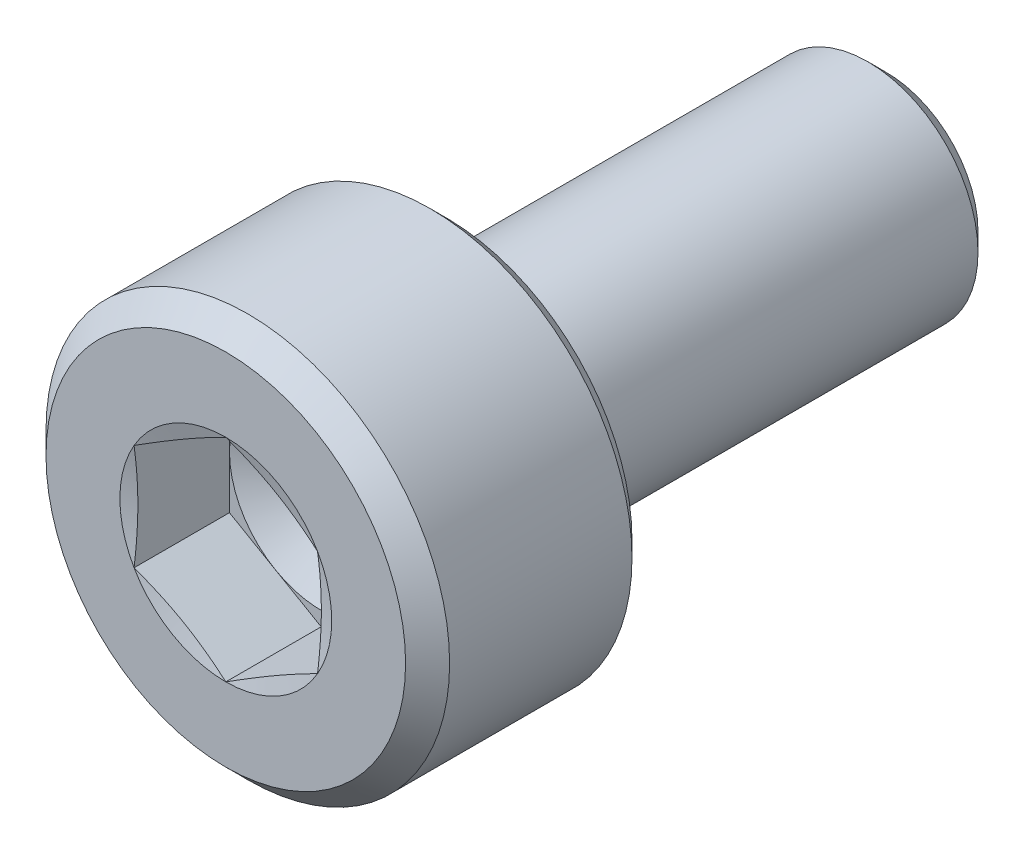
ISO-10303-21;
HEADER;
FILE_DESCRIPTION(('STEP AP214'),'2;1');
FILE_NAME('part.step','',(''),(''),'','','');
FILE_SCHEMA(('AUTOMOTIVE_DESIGN { 1 0 10303 214 1 1 1 1 }'));
ENDSEC;
DATA;
#1=APPLICATION_CONTEXT('core data for automotive mechanical design processes');
#2=APPLICATION_PROTOCOL_DEFINITION('international standard','automotive_design',2000,#1);
#3=PRODUCT_CONTEXT('',#1,'mechanical');
#4=PRODUCT('Part','Part','',(#3));
#5=PRODUCT_RELATED_PRODUCT_CATEGORY('part','',(#4));
#6=PRODUCT_DEFINITION_FORMATION('','',#4);
#7=PRODUCT_DEFINITION_CONTEXT('part definition',#1,'design');
#8=PRODUCT_DEFINITION('design','',#6,#7);
#9=PRODUCT_DEFINITION_SHAPE('','',#8);
#10=(LENGTH_UNIT() NAMED_UNIT(*) SI_UNIT(.MILLI.,.METRE.));
#11=(NAMED_UNIT(*) PLANE_ANGLE_UNIT() SI_UNIT($,.RADIAN.));
#12=(NAMED_UNIT(*) SI_UNIT($,.STERADIAN.) SOLID_ANGLE_UNIT());
#13=UNCERTAINTY_MEASURE_WITH_UNIT(LENGTH_MEASURE(1.E-05),#10,'distance_accuracy_value','');
#14=(GEOMETRIC_REPRESENTATION_CONTEXT(3) GLOBAL_UNCERTAINTY_ASSIGNED_CONTEXT((#13)) GLOBAL_UNIT_ASSIGNED_CONTEXT((#10,
#11,#12)) REPRESENTATION_CONTEXT('',''));
#15=CARTESIAN_POINT('',(0.,0.,0.));
#16=DIRECTION('',(0.,0.,1.));
#17=DIRECTION('',(1.,0.,0.));
#18=AXIS2_PLACEMENT_3D('',#15,#16,#17);
#19=CARTESIAN_POINT('',(0.,0.,0.));
#20=DIRECTION('',(0.,0.,-1.));
#21=DIRECTION('',(-1.,0.,0.));
#22=AXIS2_PLACEMENT_3D('',#19,#20,#21);
#23=PLANE('',#22);
#24=CARTESIAN_POINT('',(0.,0.,0.));
#25=DIRECTION('',(0.,0.,1.));
#26=DIRECTION('',(1.,0.,0.));
#27=AXIS2_PLACEMENT_3D('',#24,#25,#26);
#28=CIRCLE('',#27,2.44999999999999);
#29=CARTESIAN_POINT('',(2.44999999999999,0.,0.));
#30=VERTEX_POINT('',#29);
#31=EDGE_CURVE('E230',#30,#30,#28,.T.);
#32=ORIENTED_EDGE('',*,*,#31,.T.);
#33=EDGE_LOOP('',(#32));
#34=FACE_BOUND('',#33,.T.);
#35=CARTESIAN_POINT('',(0.,0.,0.));
#36=DIRECTION('',(0.,0.,1.));
#37=DIRECTION('',(1.,0.,0.));
#38=AXIS2_PLACEMENT_3D('',#35,#36,#37);
#39=CIRCLE('',#38,1.44337567297407);
#40=CARTESIAN_POINT('',(-1.25,-0.721687836487033,0.));
#41=VERTEX_POINT('',#40);
#42=CARTESIAN_POINT('',(0.,-1.44337567297407,0.));
#43=VERTEX_POINT('',#42);
#44=EDGE_CURVE('E156',#41,#43,#39,.T.);
#45=ORIENTED_EDGE('',*,*,#44,.F.);
#46=CARTESIAN_POINT('',(-1.25,0.721687836487033,0.));
#47=VERTEX_POINT('',#46);
#48=EDGE_CURVE('E155',#47,#41,#39,.T.);
#49=ORIENTED_EDGE('',*,*,#48,.F.);
#50=CARTESIAN_POINT('',(0.,1.44337567297407,0.));
#51=VERTEX_POINT('',#50);
#52=EDGE_CURVE('E122',#51,#47,#39,.T.);
#53=ORIENTED_EDGE('',*,*,#52,.F.);
#54=CARTESIAN_POINT('',(1.25,0.721687836487034,0.));
#55=VERTEX_POINT('',#54);
#56=EDGE_CURVE('E116',#55,#51,#39,.T.);
#57=ORIENTED_EDGE('',*,*,#56,.F.);
#58=CARTESIAN_POINT('',(1.25,-0.721687836487031,0.));
#59=VERTEX_POINT('',#58);
#60=EDGE_CURVE('E124',#59,#55,#39,.T.);
#61=ORIENTED_EDGE('',*,*,#60,.F.);
#62=EDGE_CURVE('E314',#43,#59,#39,.T.);
#63=ORIENTED_EDGE('',*,*,#62,.F.);
#64=EDGE_LOOP('',(#45,#49,#53,#57,#61,#63));
#65=FACE_BOUND('',#64,.T.);
#66=ADVANCED_FACE('F39',(#34,#65),#23,.F.);
#67=CARTESIAN_POINT('',(0.,0.,-0.3));
#68=DIRECTION('',(0.,0.,-1.));
#69=DIRECTION('',(-1.,0.,0.));
#70=AXIS2_PLACEMENT_3D('',#67,#68,#69);
#71=CONICAL_SURFACE('',#70,2.75,0.78539816339746);
#72=ORIENTED_EDGE('',*,*,#31,.F.);
#73=EDGE_LOOP('',(#72));
#74=FACE_BOUND('',#73,.T.);
#75=CARTESIAN_POINT('',(0.,0.,-0.3));
#76=DIRECTION('',(0.,0.,1.));
#77=DIRECTION('',(1.,0.,0.));
#78=AXIS2_PLACEMENT_3D('',#75,#76,#77);
#79=CIRCLE('',#78,2.75);
#80=CARTESIAN_POINT('',(2.75,0.,-0.3));
#81=VERTEX_POINT('',#80);
#82=EDGE_CURVE('E232',#81,#81,#79,.T.);
#83=ORIENTED_EDGE('',*,*,#82,.T.);
#84=EDGE_LOOP('',(#83));
#85=FACE_BOUND('',#84,.T.);
#86=ADVANCED_FACE('F221',(#74,#85),#71,.T.);
#87=CARTESIAN_POINT('',(0.,0.,0.));
#88=DIRECTION('',(0.,0.,1.));
#89=DIRECTION('',(1.,0.,0.));
#90=AXIS2_PLACEMENT_3D('',#87,#88,#89);
#91=CYLINDRICAL_SURFACE('',#90,2.75);
#92=ORIENTED_EDGE('',*,*,#82,.F.);
#93=EDGE_LOOP('',(#92));
#94=FACE_BOUND('',#93,.T.);
#95=CARTESIAN_POINT('',(0.,0.,-2.785));
#96=DIRECTION('',(0.,0.,1.));
#97=DIRECTION('',(1.,0.,0.));
#98=AXIS2_PLACEMENT_3D('',#95,#96,#97);
#99=CIRCLE('',#98,2.75);
#100=CARTESIAN_POINT('',(2.75,0.,-2.785));
#101=VERTEX_POINT('',#100);
#102=EDGE_CURVE('E235',#101,#101,#99,.T.);
#103=ORIENTED_EDGE('',*,*,#102,.T.);
#104=EDGE_LOOP('',(#103));
#105=FACE_BOUND('',#104,.T.);
#106=ADVANCED_FACE('F226',(#94,#105),#91,.T.);
#107=CARTESIAN_POINT('',(0.,0.,-3.));
#108=DIRECTION('',(0.,0.,1.));
#109=DIRECTION('',(1.,0.,0.));
#110=AXIS2_PLACEMENT_3D('',#107,#108,#109);
#111=CONICAL_SURFACE('',#110,2.535,0.785398163397449);
#112=ORIENTED_EDGE('',*,*,#102,.F.);
#113=EDGE_LOOP('',(#112));
#114=FACE_BOUND('',#113,.T.);
#115=CARTESIAN_POINT('',(0.,0.,-3.));
#116=DIRECTION('',(0.,0.,1.));
#117=DIRECTION('',(1.,0.,0.));
#118=AXIS2_PLACEMENT_3D('',#115,#116,#117);
#119=CIRCLE('',#118,2.535);
#120=CARTESIAN_POINT('',(2.535,0.,-3.));
#121=VERTEX_POINT('',#120);
#122=EDGE_CURVE('E240',#121,#121,#119,.T.);
#123=ORIENTED_EDGE('',*,*,#122,.T.);
#124=EDGE_LOOP('',(#123));
#125=FACE_BOUND('',#124,.T.);
#126=ADVANCED_FACE('F430',(#114,#125),#111,.T.);
#127=CARTESIAN_POINT('',(0.,2.535,-3.));
#128=DIRECTION('',(0.,0.,1.));
#129=DIRECTION('',(1.,0.,0.));
#130=AXIS2_PLACEMENT_3D('',#127,#128,#129);
#131=PLANE('',#130);
#132=ORIENTED_EDGE('',*,*,#122,.F.);
#133=EDGE_LOOP('',(#132));
#134=FACE_BOUND('',#133,.T.);
#135=CARTESIAN_POINT('',(0.,0.,-3.));
#136=DIRECTION('',(0.,0.,1.));
#137=DIRECTION('',(1.,0.,0.));
#138=AXIS2_PLACEMENT_3D('',#135,#136,#137);
#139=CIRCLE('',#138,1.8);
#140=CARTESIAN_POINT('',(1.8,0.,-3.));
#141=VERTEX_POINT('',#140);
#142=EDGE_CURVE('E243',#141,#141,#139,.T.);
#143=ORIENTED_EDGE('',*,*,#142,.T.);
#144=EDGE_LOOP('',(#143));
#145=FACE_BOUND('',#144,.T.);
#146=ADVANCED_FACE('F422',(#134,#145),#131,.F.);
#147=CARTESIAN_POINT('',(0.,0.,-3.1));
#148=DIRECTION('',(0.,0.,1.));
#149=DIRECTION('',(1.,0.,0.));
#150=AXIS2_PLACEMENT_3D('',#147,#148,#149);
#151=TOROIDAL_SURFACE('',#150,1.8,0.1);
#152=ORIENTED_EDGE('',*,*,#142,.F.);
#153=EDGE_LOOP('',(#152));
#154=FACE_BOUND('',#153,.T.);
#155=CARTESIAN_POINT('',(0.,0.,-3.05615763679786));
#156=DIRECTION('',(0.,0.,1.));
#157=DIRECTION('',(1.,0.,0.));
#158=AXIS2_PLACEMENT_3D('',#155,#156,#157);
#159=CIRCLE('',#158,1.71012315543561);
#160=CARTESIAN_POINT('',(1.71012315543561,0.,-3.05615763679786));
#161=VERTEX_POINT('',#160);
#162=EDGE_CURVE('E246',#161,#161,#159,.T.);
#163=ORIENTED_EDGE('',*,*,#162,.T.);
#164=EDGE_LOOP('',(#163));
#165=FACE_BOUND('',#164,.T.);
#166=ADVANCED_FACE('F414',(#154,#165),#151,.F.);
#167=CARTESIAN_POINT('',(0.,0.,-3.46615763679786));
#168=DIRECTION('',(0.,0.,1.));
#169=DIRECTION('',(1.,0.,0.));
#170=AXIS2_PLACEMENT_3D('',#167,#168,#169);
#171=CONICAL_SURFACE('',#170,1.51012315543561,0.453844001521511);
#172=ORIENTED_EDGE('',*,*,#162,.F.);
#173=EDGE_LOOP('',(#172));
#174=FACE_BOUND('',#173,.T.);
#175=CARTESIAN_POINT('',(0.,0.,-3.46615763679786));
#176=DIRECTION('',(0.,0.,1.));
#177=DIRECTION('',(1.,0.,0.));
#178=AXIS2_PLACEMENT_3D('',#175,#176,#177);
#179=CIRCLE('',#178,1.51012315543561);
#180=CARTESIAN_POINT('',(1.51012315543561,0.,-3.46615763679786));
#181=VERTEX_POINT('',#180);
#182=EDGE_CURVE('E249',#181,#181,#179,.T.);
#183=ORIENTED_EDGE('',*,*,#182,.T.);
#184=EDGE_LOOP('',(#183));
#185=FACE_BOUND('',#184,.T.);
#186=ADVANCED_FACE('F406',(#174,#185),#171,.T.);
#187=CARTESIAN_POINT('',(0.,0.,-3.51));
#188=DIRECTION('',(0.,0.,1.));
#189=DIRECTION('',(1.,0.,0.));
#190=AXIS2_PLACEMENT_3D('',#187,#188,#189);
#191=TOROIDAL_SURFACE('',#190,1.6,0.1);
#192=ORIENTED_EDGE('',*,*,#182,.F.);
#193=EDGE_LOOP('',(#192));
#194=FACE_BOUND('',#193,.T.);
#195=CARTESIAN_POINT('',(0.,0.,-3.51));
#196=DIRECTION('',(0.,0.,1.));
#197=DIRECTION('',(1.,0.,0.));
#198=AXIS2_PLACEMENT_3D('',#195,#196,#197);
#199=CIRCLE('',#198,1.5);
#200=CARTESIAN_POINT('',(1.5,0.,-3.51));
#201=VERTEX_POINT('',#200);
#202=EDGE_CURVE('E252',#201,#201,#199,.T.);
#203=ORIENTED_EDGE('',*,*,#202,.T.);
#204=EDGE_LOOP('',(#203));
#205=FACE_BOUND('',#204,.T.);
#206=ADVANCED_FACE('F398',(#194,#205),#191,.F.);
#207=CARTESIAN_POINT('',(0.,0.,0.));
#208=DIRECTION('',(0.,0.,1.));
#209=DIRECTION('',(1.,0.,0.));
#210=AXIS2_PLACEMENT_3D('',#207,#208,#209);
#211=CYLINDRICAL_SURFACE('',#210,1.5);
#212=ORIENTED_EDGE('',*,*,#202,.F.);
#213=EDGE_LOOP('',(#212));
#214=FACE_BOUND('',#213,.T.);
#215=CARTESIAN_POINT('',(0.,0.,-8.75));
#216=DIRECTION('',(0.,0.,1.));
#217=DIRECTION('',(1.,0.,0.));
#218=AXIS2_PLACEMENT_3D('',#215,#216,#217);
#219=CIRCLE('',#218,1.5);
#220=CARTESIAN_POINT('',(1.5,0.,-8.75));
#221=VERTEX_POINT('',#220);
#222=EDGE_CURVE('E255',#221,#221,#219,.T.);
#223=ORIENTED_EDGE('',*,*,#222,.T.);
#224=EDGE_LOOP('',(#223));
#225=FACE_BOUND('',#224,.T.);
#226=ADVANCED_FACE('F389',(#214,#225),#211,.T.);
#227=CARTESIAN_POINT('',(0.,0.,-9.));
#228=DIRECTION('',(0.,0.,1.));
#229=DIRECTION('',(1.,0.,0.));
#230=AXIS2_PLACEMENT_3D('',#227,#228,#229);
#231=CONICAL_SURFACE('',#230,1.25,0.785398163397438);
#232=ORIENTED_EDGE('',*,*,#222,.F.);
#233=EDGE_LOOP('',(#232));
#234=FACE_BOUND('',#233,.T.);
#235=CARTESIAN_POINT('',(0.,0.,-9.));
#236=DIRECTION('',(0.,0.,1.));
#237=DIRECTION('',(1.,0.,0.));
#238=AXIS2_PLACEMENT_3D('',#235,#236,#237);
#239=CIRCLE('',#238,1.25);
#240=CARTESIAN_POINT('',(1.25,0.,-9.));
#241=VERTEX_POINT('',#240);
#242=EDGE_CURVE('E258',#241,#241,#239,.T.);
#243=ORIENTED_EDGE('',*,*,#242,.T.);
#244=EDGE_LOOP('',(#243));
#245=FACE_BOUND('',#244,.T.);
#246=ADVANCED_FACE('F381',(#234,#245),#231,.T.);
#247=CARTESIAN_POINT('',(0.,1.25,-9.));
#248=DIRECTION('',(0.,0.,1.));
#249=DIRECTION('',(1.,0.,0.));
#250=AXIS2_PLACEMENT_3D('',#247,#248,#249);
#251=PLANE('',#250);
#252=ORIENTED_EDGE('',*,*,#242,.F.);
#253=EDGE_LOOP('',(#252));
#254=FACE_BOUND('',#253,.T.);
#255=ADVANCED_FACE('F375',(#254),#251,.F.);
#256=CARTESIAN_POINT('',(0.,0.,-0.0518148554092243));
#257=DIRECTION('',(0.,0.,1.));
#258=DIRECTION('',(1.,0.,0.));
#259=AXIS2_PLACEMENT_3D('',#256,#257,#258);
#260=CONICAL_SURFACE('',#259,1.25,1.30899693899575);
#261=ORIENTED_EDGE('',*,*,#52,.T.);
#262=CARTESIAN_POINT('',(-1.2502,0.721572366433195,3.09438201916871E-05));
#263=CARTESIAN_POINT('',(-1.19827409383526,0.751551802335321,-0.00800698378926622));
#264=CARTESIAN_POINT('',(-1.14625401362102,0.781585609650283,-0.0153042105125454));
#265=CARTESIAN_POINT('',(-1.04203006351459,0.841759335300235,-0.0281248924452036));
#266=CARTESIAN_POINT('',(-0.989826127596593,0.871899291755248,-0.0336476265269101));
#267=CARTESIAN_POINT('',(-0.88555111655682,0.932102497448812,-0.0425967858491088));
#268=CARTESIAN_POINT('',(-0.833480747184869,0.962165339222511,-0.0460338877791617));
#269=CARTESIAN_POINT('',(-0.729273575326724,1.0223293779463,-0.0506427032068));
#270=CARTESIAN_POINT('',(-0.677136787663362,1.05243056633842,-0.0518148554092241));
#271=CARTESIAN_POINT('',(-0.572863212336638,1.11263294312267,-0.0518148554092241));
#272=CARTESIAN_POINT('',(-0.520726424673275,1.1427341315148,-0.0506427032068001));
#273=CARTESIAN_POINT('',(-0.416519252815131,1.20289817023859,-0.0460338877791617));
#274=CARTESIAN_POINT('',(-0.36444888344318,1.23296101201229,-0.0425967858491088));
#275=CARTESIAN_POINT('',(-0.260173872403407,1.29316421770585,-0.03364762652691));
#276=CARTESIAN_POINT('',(-0.207969936485411,1.32330417416086,-0.0281248924452036));
#277=CARTESIAN_POINT('',(-0.103745986378985,1.38347789981082,-0.0153042105125453));
#278=CARTESIAN_POINT('',(-0.0517259061647358,1.41351170712578,-0.00800698378926612));
#279=CARTESIAN_POINT('',(0.00020000000000038,1.4434911430279,3.09438201918299E-05));
#280=B_SPLINE_CURVE_WITH_KNOTS('',3,(#262,#263,#264,#265,#266,#267,#268,#269,#270,#271,#272,
#273,#274,#275,#276,#277,#278,#279),.UNSPECIFIED.,.F.,.F.,(4,2,2,2,2,2,2,2,4),(0.,
0.18149525192516,0.363064167833313,0.543695584294992,0.724292010212745,0.9048884361305,
1.08551985259218,1.26708876850033,1.44858402042549),.UNSPECIFIED.);
#281=EDGE_CURVE('E11',#47,#51,#280,.T.);
#282=ORIENTED_EDGE('',*,*,#281,.T.);
#283=EDGE_LOOP('',(#261,#282));
#284=FACE_BOUND('',#283,.T.);
#285=ADVANCED_FACE('F128',(#284),#260,.F.);
#286=CARTESIAN_POINT('',(-1.25,-1.90803764372689,0.224449375411132));
#287=CARTESIAN_POINT('',(-1.25,-1.8513410457493,0.21174373926854));
#288=CARTESIAN_POINT('',(-1.25,-1.79460907964503,0.199195804458375));
#289=CARTESIAN_POINT('',(-1.25,-1.68105673477474,0.174495010900465));
#290=CARTESIAN_POINT('',(-1.25,-1.62423635229394,0.162342169249333));
#291=CARTESIAN_POINT('',(-1.25,-1.4535135757121,0.126574423752231));
#292=CARTESIAN_POINT('',(-1.25,-1.33945900339908,0.103675151182616));
#293=CARTESIAN_POINT('',(-1.25,-1.11170727260793,0.0609587630346281));
#294=CARTESIAN_POINT('',(-1.25,-0.998014548362105,0.0411184667683871));
#295=CARTESIAN_POINT('',(-1.25,-0.769948454688276,0.00583266905587686));
#296=CARTESIAN_POINT('',(-1.25,-0.655575207287998,-0.00961359741797872));
#297=CARTESIAN_POINT('',(-1.25,-0.424787181644499,-0.0341426384914952));
#298=CARTESIAN_POINT('',(-1.25,-0.308363938645654,-0.0431515305449703));
#299=CARTESIAN_POINT('',(-1.25,-0.133499226938177,-0.0502674214127566));
#300=CARTESIAN_POINT('',(-1.25,-0.0751823293286765,-0.0515734559811251));
#301=CARTESIAN_POINT('',(-1.25,0.0414593912908041,-0.0519953132862497));
#302=CARTESIAN_POINT('',(-1.25,0.0997842142946219,-0.0511111377164467));
#303=CARTESIAN_POINT('',(-1.25,0.275064939261687,-0.0452058780708578));
#304=CARTESIAN_POINT('',(-1.25,0.391917619612776,-0.0369155048717787));
#305=CARTESIAN_POINT('',(-1.25,0.624955711707257,-0.013420604100275));
#306=CARTESIAN_POINT('',(-1.25,0.741140574853819,0.00178895996036897));
#307=CARTESIAN_POINT('',(-1.25,0.965009686747211,0.0357098573203466));
#308=CARTESIAN_POINT('',(-1.25,1.07274149713457,0.0541179629895213));
#309=CARTESIAN_POINT('',(-1.25,1.28770836040789,0.0936619087242774));
#310=CARTESIAN_POINT('',(-1.25,1.39494334881407,0.114798093117207));
#311=CARTESIAN_POINT('',(-1.25,1.60905523406172,0.158897571848756));
#312=CARTESIAN_POINT('',(-1.25,1.71593205434096,0.181861233731142));
#313=CARTESIAN_POINT('',(-1.25,1.92941059122614,0.229035853527515));
#314=CARTESIAN_POINT('',(-1.25,2.0360123020935,0.253246837242345));
#315=CARTESIAN_POINT('',(-1.25,2.24796149236902,0.302300913060499));
#316=CARTESIAN_POINT('',(-1.25,2.35331096915779,0.32713541151495));
#317=CARTESIAN_POINT('',(-1.25,2.56386296226419,0.377426560036597));
#318=CARTESIAN_POINT('',(-1.25,2.66906547587909,0.402883221390532));
#319=CARTESIAN_POINT('',(-1.25,2.87922866754162,0.454224569867166));
#320=CARTESIAN_POINT('',(-1.25,2.98418948388924,0.4801086920956));
#321=CARTESIAN_POINT('',(-1.25,3.19401964928918,0.53223064686748));
#322=CARTESIAN_POINT('',(-1.25,3.29888900123911,0.558468467737611));
#323=CARTESIAN_POINT('',(-1.25,3.40372646605654,0.5848316076134));
#324=B_SPLINE_CURVE_WITH_KNOTS('',3,(#286,#287,#288,#289,#290,#291,#292,#293,#294,#295,#296,
#297,#298,#299,#300,#301,#302,#303,#304,#305,#306,#307,#308,#309,#310,#311,#312,#313,#314,#315,
#316,#317,#318,#319,#320,#321,#322,#323),.UNSPECIFIED.,.F.,.F.,(4,2,2,2,2,2,2,2,2,2,2,2,2,2,2,2,
2,2,4),(0.,0.17430798332962,0.348623499364559,0.697591208701206,1.04376859165833,
1.38988566606611,1.73991400543005,1.91487041156219,2.08982668242046,2.44096537417444,
2.79236007022679,3.12019018011378,3.44806170796195,3.77599934506425,4.10394376827983,
4.4286525086615,4.75336714400545,5.07768244044904,5.40198705941089),.UNSPECIFIED.);
#325=EDGE_CURVE('E121',#41,#47,#324,.T.);
#326=ORIENTED_EDGE('',*,*,#325,.T.);
#327=ORIENTED_EDGE('',*,*,#48,.T.);
#328=EDGE_LOOP('',(#326,#327));
#329=FACE_BOUND('',#328,.T.);
#330=ADVANCED_FACE('F362',(#329),#260,.F.);
#331=CARTESIAN_POINT('',(0.000199999999999765,-1.4434911430279,3.09438201913897E-05));
#332=CARTESIAN_POINT('',(-0.0517259061647364,-1.41351170712578,-0.0080069837892665));
#333=CARTESIAN_POINT('',(-0.103745986378985,-1.38347789981081,-0.0153042105125457));
#334=CARTESIAN_POINT('',(-0.207969936485412,-1.32330417416086,-0.028124892445204));
#335=CARTESIAN_POINT('',(-0.260173872403408,-1.29316421770585,-0.0336476265269104));
#336=CARTESIAN_POINT('',(-0.36444888344318,-1.23296101201229,-0.0425967858491091));
#337=CARTESIAN_POINT('',(-0.416519252815131,-1.20289817023859,-0.046033887779162));
#338=CARTESIAN_POINT('',(-0.520726424673276,-1.1427341315148,-0.0506427032068003));
#339=CARTESIAN_POINT('',(-0.572863212336638,-1.11263294312267,-0.0518148554092244));
#340=CARTESIAN_POINT('',(-0.677136787663362,-1.05243056633842,-0.0518148554092244));
#341=CARTESIAN_POINT('',(-0.729273575326725,-1.0223293779463,-0.0506427032068003));
#342=CARTESIAN_POINT('',(-0.833480747184869,-0.962165339222509,-0.046033887779162));
#343=CARTESIAN_POINT('',(-0.88555111655682,-0.93210249744881,-0.0425967858491091));
#344=CARTESIAN_POINT('',(-0.989826127596593,-0.871899291755246,-0.0336476265269103));
#345=CARTESIAN_POINT('',(-1.04203006351459,-0.841759335300233,-0.0281248924452038));
#346=CARTESIAN_POINT('',(-1.14625401362102,-0.781585609650282,-0.0153042105125455));
#347=CARTESIAN_POINT('',(-1.19827409383526,-0.75155180233532,-0.00800698378926632));
#348=CARTESIAN_POINT('',(-1.2502,-0.721572366433194,3.09438201915463E-05));
#349=B_SPLINE_CURVE_WITH_KNOTS('',3,(#331,#332,#333,#334,#335,#336,#337,#338,#339,#340,#341,
#342,#343,#344,#345,#346,#347,#348),.UNSPECIFIED.,.F.,.F.,(4,2,2,2,2,2,2,2,4),(0.,
0.18149525192516,0.363064167833313,0.543695584294991,0.724292010212745,0.904888436130499,
1.08551985259218,1.26708876850033,1.44858402042549),.UNSPECIFIED.);
#350=EDGE_CURVE('E164',#43,#41,#349,.T.);
#351=ORIENTED_EDGE('',*,*,#350,.T.);
#352=ORIENTED_EDGE('',*,*,#44,.T.);
#353=EDGE_LOOP('',(#351,#352));
#354=FACE_BOUND('',#353,.T.);
#355=ADVANCED_FACE('F356',(#354),#260,.F.);
#356=CARTESIAN_POINT('',(1.2502,-0.721572366433195,3.09438201914613E-05));
#357=CARTESIAN_POINT('',(1.19827409383526,-0.75155180233532,-0.00800698378926647));
#358=CARTESIAN_POINT('',(1.14625401362101,-0.781585609650283,-0.0153042105125457));
#359=CARTESIAN_POINT('',(1.04203006351459,-0.841759335300234,-0.0281248924452039));
#360=CARTESIAN_POINT('',(0.989826127596592,-0.871899291755247,-0.0336476265269103));
#361=CARTESIAN_POINT('',(0.88555111655682,-0.932102497448811,-0.042596785849109));
#362=CARTESIAN_POINT('',(0.833480747184869,-0.96216533922251,-0.046033887779162));
#363=CARTESIAN_POINT('',(0.729273575326724,-1.0223293779463,-0.0506427032068003));
#364=CARTESIAN_POINT('',(0.677136787663362,-1.05243056633842,-0.0518148554092244));
#365=CARTESIAN_POINT('',(0.572863212336637,-1.11263294312267,-0.0518148554092244));
#366=CARTESIAN_POINT('',(0.520726424673275,-1.1427341315148,-0.0506427032068003));
#367=CARTESIAN_POINT('',(0.416519252815131,-1.20289817023859,-0.046033887779162));
#368=CARTESIAN_POINT('',(0.36444888344318,-1.23296101201229,-0.042596785849109));
#369=CARTESIAN_POINT('',(0.260173872403407,-1.29316421770585,-0.0336476265269103));
#370=CARTESIAN_POINT('',(0.207969936485411,-1.32330417416086,-0.028124892445204));
#371=CARTESIAN_POINT('',(0.103745986378985,-1.38347789981081,-0.0153042105125458));
#372=CARTESIAN_POINT('',(0.0517259061647362,-1.41351170712578,-0.00800698378926656));
#373=CARTESIAN_POINT('',(-0.000200000000000036,-1.4434911430279,3.09438201914066E-05));
#374=B_SPLINE_CURVE_WITH_KNOTS('',3,(#356,#357,#358,#359,#360,#361,#362,#363,#364,#365,#366,
#367,#368,#369,#370,#371,#372,#373),.UNSPECIFIED.,.F.,.F.,(4,2,2,2,2,2,2,2,4),(0.,
0.18149525192516,0.363064167833312,0.543695584294991,0.724292010212745,0.904888436130499,
1.08551985259218,1.26708876850033,1.44858402042549),.UNSPECIFIED.);
#375=EDGE_CURVE('E184',#59,#43,#374,.T.);
#376=ORIENTED_EDGE('',*,*,#375,.T.);
#377=ORIENTED_EDGE('',*,*,#62,.T.);
#378=EDGE_LOOP('',(#376,#377));
#379=FACE_BOUND('',#378,.T.);
#380=ADVANCED_FACE('F350',(#379),#260,.F.);
#381=CARTESIAN_POINT('',(1.25,-1.90803764372689,0.224449375411132));
#382=CARTESIAN_POINT('',(1.25,-1.8513410457493,0.21174373926854));
#383=CARTESIAN_POINT('',(1.25,-1.79460907964503,0.199195804458375));
#384=CARTESIAN_POINT('',(1.25,-1.68105673477474,0.174495010900465));
#385=CARTESIAN_POINT('',(1.25,-1.62423635229394,0.162342169249333));
#386=CARTESIAN_POINT('',(1.25,-1.4535135757121,0.126574423752231));
#387=CARTESIAN_POINT('',(1.25,-1.33945900339908,0.103675151182616));
#388=CARTESIAN_POINT('',(1.25,-1.11170727260793,0.0609587630346278));
#389=CARTESIAN_POINT('',(1.25,-0.998014548362105,0.0411184667683869));
#390=CARTESIAN_POINT('',(1.25,-0.769948454688276,0.00583266905587672));
#391=CARTESIAN_POINT('',(1.25,-0.655575207287999,-0.00961359741797884));
#392=CARTESIAN_POINT('',(1.25,-0.4247871816445,-0.0341426384914953));
#393=CARTESIAN_POINT('',(1.25,-0.308363938645655,-0.0431515305449704));
#394=CARTESIAN_POINT('',(1.25,-0.133499226938178,-0.0502674214127568));
#395=CARTESIAN_POINT('',(1.25,-0.0751823293286781,-0.0515734559811252));
#396=CARTESIAN_POINT('',(1.25,0.0414593912908024,-0.0519953132862499));
#397=CARTESIAN_POINT('',(1.25,0.0997842142946203,-0.0511111377164469));
#398=CARTESIAN_POINT('',(1.25,0.275064939261685,-0.045205878070858));
#399=CARTESIAN_POINT('',(1.25,0.391917619612775,-0.036915504871779));
#400=CARTESIAN_POINT('',(1.25,0.624955711707256,-0.0134206041002753));
#401=CARTESIAN_POINT('',(1.25,0.741140574853817,0.00178895996036867));
#402=CARTESIAN_POINT('',(1.25,0.96500968674721,0.0357098573203462));
#403=CARTESIAN_POINT('',(1.25,1.07274149713457,0.054117962989521));
#404=CARTESIAN_POINT('',(1.25,1.28770836040789,0.093661908724277));
#405=CARTESIAN_POINT('',(1.25,1.39494334881407,0.114798093117207));
#406=CARTESIAN_POINT('',(1.25,1.60905523406172,0.158897571848756));
#407=CARTESIAN_POINT('',(1.25,1.71593205434096,0.181861233731142));
#408=CARTESIAN_POINT('',(1.25,1.92941059122614,0.229035853527516));
#409=CARTESIAN_POINT('',(1.25,2.0360123020935,0.253246837242345));
#410=CARTESIAN_POINT('',(1.25,2.24796149236902,0.302300913060499));
#411=CARTESIAN_POINT('',(1.25,2.35331096915779,0.32713541151495));
#412=CARTESIAN_POINT('',(1.25,2.56386296226419,0.377426560036597));
#413=CARTESIAN_POINT('',(1.25,2.66906547587909,0.402883221390532));
#414=CARTESIAN_POINT('',(1.25,2.87922866754162,0.454224569867166));
#415=CARTESIAN_POINT('',(1.25,2.98418948388924,0.4801086920956));
#416=CARTESIAN_POINT('',(1.25,3.19401964928918,0.53223064686748));
#417=CARTESIAN_POINT('',(1.25,3.29888900123911,0.558468467737611));
#418=CARTESIAN_POINT('',(1.25,3.40372646605654,0.5848316076134));
#419=B_SPLINE_CURVE_WITH_KNOTS('',3,(#381,#382,#383,#384,#385,#386,#387,#388,#389,#390,#391,
#392,#393,#394,#395,#396,#397,#398,#399,#400,#401,#402,#403,#404,#405,#406,#407,#408,#409,#410,
#411,#412,#413,#414,#415,#416,#417,#418),.UNSPECIFIED.,.F.,.F.,(4,2,2,2,2,2,2,2,2,2,2,2,2,2,2,2,
2,2,4),(0.,0.17430798332962,0.348623499364559,0.697591208701206,1.04376859165833,
1.38988566606611,1.73991400543005,1.91487041156219,2.08982668242046,2.44096537417444,
2.79236007022679,3.12019018011378,3.44806170796195,3.77599934506425,4.10394376827983,
4.4286525086615,4.75336714400545,5.07768244044904,5.40198705941089),.UNSPECIFIED.);
#420=EDGE_CURVE('E64',#55,#59,#419,.F.);
#421=ORIENTED_EDGE('',*,*,#420,.T.);
#422=ORIENTED_EDGE('',*,*,#60,.T.);
#423=EDGE_LOOP('',(#421,#422));
#424=FACE_BOUND('',#423,.T.);
#425=ADVANCED_FACE('F177',(#424),#260,.F.);
#426=CARTESIAN_POINT('',(-0.000199999999999885,1.4434911430279,3.09438201917452E-05));
#427=CARTESIAN_POINT('',(0.0517259061647365,1.41351170712578,-0.00800698378926616));
#428=CARTESIAN_POINT('',(0.103745986378985,1.38347789981081,-0.0153042105125454));
#429=CARTESIAN_POINT('',(0.207969936485411,1.32330417416086,-0.0281248924452036));
#430=CARTESIAN_POINT('',(0.260173872403408,1.29316421770585,-0.03364762652691));
#431=CARTESIAN_POINT('',(0.36444888344318,1.23296101201229,-0.0425967858491087));
#432=CARTESIAN_POINT('',(0.416519252815131,1.20289817023859,-0.0460338877791617));
#433=CARTESIAN_POINT('',(0.520726424673275,1.1427341315148,-0.0506427032068));
#434=CARTESIAN_POINT('',(0.572863212336638,1.11263294312267,-0.0518148554092241));
#435=CARTESIAN_POINT('',(0.677136787663362,1.05243056633842,-0.0518148554092242));
#436=CARTESIAN_POINT('',(0.729273575326724,1.0223293779463,-0.0506427032068001));
#437=CARTESIAN_POINT('',(0.833480747184869,0.962165339222511,-0.0460338877791617));
#438=CARTESIAN_POINT('',(0.88555111655682,0.932102497448812,-0.0425967858491088));
#439=CARTESIAN_POINT('',(0.989826127596592,0.871899291755248,-0.0336476265269101));
#440=CARTESIAN_POINT('',(1.04203006351459,0.841759335300235,-0.0281248924452037));
#441=CARTESIAN_POINT('',(1.14625401362101,0.781585609650283,-0.0153042105125454));
#442=CARTESIAN_POINT('',(1.19827409383526,0.751551802335321,-0.00800698378926624));
#443=CARTESIAN_POINT('',(1.2502,0.721572366433195,3.09438201916591E-05));
#444=B_SPLINE_CURVE_WITH_KNOTS('',3,(#426,#427,#428,#429,#430,#431,#432,#433,#434,#435,#436,
#437,#438,#439,#440,#441,#442,#443),.UNSPECIFIED.,.F.,.F.,(4,2,2,2,2,2,2,2,4),(0.,
0.18149525192516,0.363064167833313,0.543695584294991,0.724292010212745,0.904888436130499,
1.08551985259218,1.26708876850033,1.44858402042549),.UNSPECIFIED.);
#445=EDGE_CURVE('E58',#51,#55,#444,.T.);
#446=ORIENTED_EDGE('',*,*,#445,.T.);
#447=ORIENTED_EDGE('',*,*,#56,.T.);
#448=EDGE_LOOP('',(#446,#447));
#449=FACE_BOUND('',#448,.T.);
#450=ADVANCED_FACE('F117',(#449),#260,.F.);
#451=CARTESIAN_POINT('',(0.,0.,-2.02168783648703));
#452=DIRECTION('',(0.,0.,1.));
#453=DIRECTION('',(1.,0.,0.));
#454=AXIS2_PLACEMENT_3D('',#451,#452,#453);
#455=CONICAL_SURFACE('',#454,0.,1.0471975511966);
#456=CARTESIAN_POINT('',(0.,0.,-1.3));
#457=DIRECTION('',(0.,0.,1.));
#458=DIRECTION('',(1.,0.,0.));
#459=AXIS2_PLACEMENT_3D('',#456,#457,#458);
#460=CIRCLE('',#459,1.25);
#461=CARTESIAN_POINT('',(1.25,0.,-1.3));
#462=VERTEX_POINT('',#461);
#463=CARTESIAN_POINT('',(0.625,1.08253175473055,-1.3));
#464=VERTEX_POINT('',#463);
#465=EDGE_CURVE('E144',#462,#464,#460,.T.);
#466=ORIENTED_EDGE('',*,*,#465,.T.);
#467=CARTESIAN_POINT('',(-0.625,1.08253175473055,-1.3));
#468=VERTEX_POINT('',#467);
#469=EDGE_CURVE('E52',#464,#468,#460,.T.);
#470=ORIENTED_EDGE('',*,*,#469,.T.);
#471=CARTESIAN_POINT('',(-1.25,0.,-1.3));
#472=VERTEX_POINT('',#471);
#473=EDGE_CURVE('E295',#468,#472,#460,.T.);
#474=ORIENTED_EDGE('',*,*,#473,.T.);
#475=CARTESIAN_POINT('',(-0.625,-1.08253175473055,-1.3));
#476=VERTEX_POINT('',#475);
#477=EDGE_CURVE('E297',#472,#476,#460,.T.);
#478=ORIENTED_EDGE('',*,*,#477,.T.);
#479=CARTESIAN_POINT('',(0.624999999999999,-1.08253175473055,-1.3));
#480=VERTEX_POINT('',#479);
#481=EDGE_CURVE('E233',#476,#480,#460,.T.);
#482=ORIENTED_EDGE('',*,*,#481,.T.);
#483=EDGE_CURVE('E231',#480,#462,#460,.T.);
#484=ORIENTED_EDGE('',*,*,#483,.T.);
#485=EDGE_LOOP('',(#466,#470,#474,#478,#482,#484));
#486=FACE_BOUND('',#485,.T.);
#487=CARTESIAN_POINT('',(0.,0.,-2.02168783648703));
#488=VERTEX_POINT('',#487);
#489=VERTEX_LOOP('',#488);
#490=FACE_BOUND('',#489,.T.);
#491=ADVANCED_FACE('F176',(#486,#490),#455,.F.);
#492=CARTESIAN_POINT('',(0.,0.,-1.3));
#493=DIRECTION('',(0.,0.,1.));
#494=DIRECTION('',(1.,0.,0.));
#495=AXIS2_PLACEMENT_3D('',#492,#493,#494);
#496=PLANE('',#495);
#497=ORIENTED_EDGE('',*,*,#465,.F.);
#498=DIRECTION('',(0.,1.,0.));
#499=VECTOR('',#498,1.);
#500=CARTESIAN_POINT('',(1.25,-0.721687836487033,-1.3));
#501=LINE('',#500,#499);
#502=CARTESIAN_POINT('',(1.25,0.721687836487033,-1.3));
#503=VERTEX_POINT('',#502);
#504=EDGE_CURVE('E274',#462,#503,#501,.T.);
#505=ORIENTED_EDGE('',*,*,#504,.T.);
#506=DIRECTION('',(-0.866025403784439,0.5,0.));
#507=VECTOR('',#506,1.);
#508=CARTESIAN_POINT('',(1.25,0.721687836487033,-1.3));
#509=LINE('',#508,#507);
#510=EDGE_CURVE('E289',#503,#464,#509,.T.);
#511=ORIENTED_EDGE('',*,*,#510,.T.);
#512=EDGE_LOOP('',(#497,#505,#511));
#513=FACE_BOUND('',#512,.T.);
#514=ADVANCED_FACE('F319',(#513),#496,.T.);
#515=ORIENTED_EDGE('',*,*,#483,.F.);
#516=DIRECTION('',(0.866025403784439,0.5,0.));
#517=VECTOR('',#516,1.);
#518=CARTESIAN_POINT('',(0.,-1.44337567297406,-1.3));
#519=LINE('',#518,#517);
#520=CARTESIAN_POINT('',(1.25,-0.721687836487033,-1.3));
#521=VERTEX_POINT('',#520);
#522=EDGE_CURVE('E278',#480,#521,#519,.T.);
#523=ORIENTED_EDGE('',*,*,#522,.T.);
#524=EDGE_CURVE('E151',#521,#462,#501,.T.);
#525=ORIENTED_EDGE('',*,*,#524,.T.);
#526=EDGE_LOOP('',(#515,#523,#525));
#527=FACE_BOUND('',#526,.T.);
#528=ADVANCED_FACE('F207',(#527),#496,.T.);
#529=ORIENTED_EDGE('',*,*,#481,.F.);
#530=DIRECTION('',(0.866025403784439,-0.5,0.));
#531=VECTOR('',#530,1.);
#532=CARTESIAN_POINT('',(-1.25,-0.721687836487032,-1.3));
#533=LINE('',#532,#531);
#534=CARTESIAN_POINT('',(0.,-1.44337567297406,-1.3));
#535=VERTEX_POINT('',#534);
#536=EDGE_CURVE('E282',#476,#535,#533,.T.);
#537=ORIENTED_EDGE('',*,*,#536,.T.);
#538=EDGE_CURVE('E275',#535,#480,#519,.T.);
#539=ORIENTED_EDGE('',*,*,#538,.T.);
#540=EDGE_LOOP('',(#529,#537,#539));
#541=FACE_BOUND('',#540,.T.);
#542=ADVANCED_FACE('F310',(#541),#496,.T.);
#543=ORIENTED_EDGE('',*,*,#477,.F.);
#544=DIRECTION('',(0.,-1.,0.));
#545=VECTOR('',#544,1.);
#546=CARTESIAN_POINT('',(-1.25,0.721687836487033,-1.3));
#547=LINE('',#546,#545);
#548=CARTESIAN_POINT('',(-1.25,-0.721687836487032,-1.3));
#549=VERTEX_POINT('',#548);
#550=EDGE_CURVE('E286',#472,#549,#547,.T.);
#551=ORIENTED_EDGE('',*,*,#550,.T.);
#552=EDGE_CURVE('E279',#549,#476,#533,.T.);
#553=ORIENTED_EDGE('',*,*,#552,.T.);
#554=EDGE_LOOP('',(#543,#551,#553));
#555=FACE_BOUND('',#554,.T.);
#556=ADVANCED_FACE('F324',(#555),#496,.T.);
#557=ORIENTED_EDGE('',*,*,#469,.F.);
#558=CARTESIAN_POINT('',(0.,1.44337567297407,-1.3));
#559=VERTEX_POINT('',#558);
#560=EDGE_CURVE('E291',#464,#559,#509,.T.);
#561=ORIENTED_EDGE('',*,*,#560,.T.);
#562=DIRECTION('',(-0.866025403784439,-0.5,0.));
#563=VECTOR('',#562,1.);
#564=CARTESIAN_POINT('',(0.,1.44337567297407,-1.3));
#565=LINE('',#564,#563);
#566=EDGE_CURVE('E149',#559,#468,#565,.T.);
#567=ORIENTED_EDGE('',*,*,#566,.T.);
#568=EDGE_LOOP('',(#557,#561,#567));
#569=FACE_BOUND('',#568,.T.);
#570=ADVANCED_FACE('F321',(#569),#496,.T.);
#571=ORIENTED_EDGE('',*,*,#473,.F.);
#572=CARTESIAN_POINT('',(-1.25,0.721687836487033,-1.3));
#573=VERTEX_POINT('',#572);
#574=EDGE_CURVE('E288',#468,#573,#565,.T.);
#575=ORIENTED_EDGE('',*,*,#574,.T.);
#576=EDGE_CURVE('E283',#573,#472,#547,.T.);
#577=ORIENTED_EDGE('',*,*,#576,.T.);
#578=EDGE_LOOP('',(#571,#575,#577));
#579=FACE_BOUND('',#578,.T.);
#580=ADVANCED_FACE('F323',(#579),#496,.T.);
#581=CARTESIAN_POINT('',(0.,1.44337567297407,-1.3));
#582=DIRECTION('',(-0.5,0.866025403784439,0.));
#583=DIRECTION('',(-0.866025403784439,-0.5,0.));
#584=AXIS2_PLACEMENT_3D('',#581,#582,#583);
#585=PLANE('',#584);
#586=ORIENTED_EDGE('',*,*,#281,.F.);
#587=DIRECTION('',(0.,0.,1.));
#588=VECTOR('',#587,1.);
#589=CARTESIAN_POINT('',(-1.25,0.721687836487033,-1.3));
#590=LINE('',#589,#588);
#591=EDGE_CURVE('E150',#573,#47,#590,.T.);
#592=ORIENTED_EDGE('',*,*,#591,.F.);
#593=ORIENTED_EDGE('',*,*,#574,.F.);
#594=ORIENTED_EDGE('',*,*,#566,.F.);
#595=DIRECTION('',(0.,0.,1.));
#596=VECTOR('',#595,1.);
#597=CARTESIAN_POINT('',(0.,1.44337567297407,-1.3));
#598=LINE('',#597,#596);
#599=EDGE_CURVE('E139',#559,#51,#598,.T.);
#600=ORIENTED_EDGE('',*,*,#599,.T.);
#601=EDGE_LOOP('',(#586,#592,#593,#594,#600));
#602=FACE_BOUND('',#601,.T.);
#603=ADVANCED_FACE('F146',(#602),#585,.F.);
#604=CARTESIAN_POINT('',(-1.25,0.721687836487033,-1.3));
#605=DIRECTION('',(-1.,0.,0.));
#606=DIRECTION('',(0.,0.,1.));
#607=AXIS2_PLACEMENT_3D('',#604,#605,#606);
#608=PLANE('',#607);
#609=ORIENTED_EDGE('',*,*,#325,.F.);
#610=DIRECTION('',(0.,0.,1.));
#611=VECTOR('',#610,1.);
#612=CARTESIAN_POINT('',(-1.25,-0.721687836487032,-1.3));
#613=LINE('',#612,#611);
#614=EDGE_CURVE('E262',#549,#41,#613,.T.);
#615=ORIENTED_EDGE('',*,*,#614,.F.);
#616=ORIENTED_EDGE('',*,*,#550,.F.);
#617=ORIENTED_EDGE('',*,*,#576,.F.);
#618=ORIENTED_EDGE('',*,*,#591,.T.);
#619=EDGE_LOOP('',(#609,#615,#616,#617,#618));
#620=FACE_BOUND('',#619,.T.);
#621=ADVANCED_FACE('F171',(#620),#608,.F.);
#622=CARTESIAN_POINT('',(-1.25,-0.721687836487032,-1.3));
#623=DIRECTION('',(-0.5,-0.866025403784439,0.));
#624=DIRECTION('',(0.866025403784439,-0.5,0.));
#625=AXIS2_PLACEMENT_3D('',#622,#623,#624);
#626=PLANE('',#625);
#627=ORIENTED_EDGE('',*,*,#350,.F.);
#628=DIRECTION('',(0.,0.,1.));
#629=VECTOR('',#628,1.);
#630=CARTESIAN_POINT('',(0.,-1.44337567297406,-1.3));
#631=LINE('',#630,#629);
#632=EDGE_CURVE('E265',#535,#43,#631,.T.);
#633=ORIENTED_EDGE('',*,*,#632,.F.);
#634=ORIENTED_EDGE('',*,*,#536,.F.);
#635=ORIENTED_EDGE('',*,*,#552,.F.);
#636=ORIENTED_EDGE('',*,*,#614,.T.);
#637=EDGE_LOOP('',(#627,#633,#634,#635,#636));
#638=FACE_BOUND('',#637,.T.);
#639=ADVANCED_FACE('F210',(#638),#626,.F.);
#640=CARTESIAN_POINT('',(0.,-1.44337567297406,-1.3));
#641=DIRECTION('',(0.5,-0.866025403784439,0.));
#642=DIRECTION('',(0.866025403784439,0.5,0.));
#643=AXIS2_PLACEMENT_3D('',#640,#641,#642);
#644=PLANE('',#643);
#645=ORIENTED_EDGE('',*,*,#375,.F.);
#646=DIRECTION('',(0.,0.,1.));
#647=VECTOR('',#646,1.);
#648=CARTESIAN_POINT('',(1.25,-0.721687836487033,-1.3));
#649=LINE('',#648,#647);
#650=EDGE_CURVE('E268',#521,#59,#649,.T.);
#651=ORIENTED_EDGE('',*,*,#650,.F.);
#652=ORIENTED_EDGE('',*,*,#522,.F.);
#653=ORIENTED_EDGE('',*,*,#538,.F.);
#654=ORIENTED_EDGE('',*,*,#632,.T.);
#655=EDGE_LOOP('',(#645,#651,#652,#653,#654));
#656=FACE_BOUND('',#655,.T.);
#657=ADVANCED_FACE('F205',(#656),#644,.F.);
#658=CARTESIAN_POINT('',(1.25,-0.721687836487033,-1.3));
#659=DIRECTION('',(1.,0.,0.));
#660=DIRECTION('',(0.,1.,0.));
#661=AXIS2_PLACEMENT_3D('',#658,#659,#660);
#662=PLANE('',#661);
#663=ORIENTED_EDGE('',*,*,#420,.F.);
#664=DIRECTION('',(0.,0.,1.));
#665=VECTOR('',#664,1.);
#666=CARTESIAN_POINT('',(1.25,0.721687836487033,-1.3));
#667=LINE('',#666,#665);
#668=EDGE_CURVE('E143',#503,#55,#667,.T.);
#669=ORIENTED_EDGE('',*,*,#668,.F.);
#670=ORIENTED_EDGE('',*,*,#504,.F.);
#671=ORIENTED_EDGE('',*,*,#524,.F.);
#672=ORIENTED_EDGE('',*,*,#650,.T.);
#673=EDGE_LOOP('',(#663,#669,#670,#671,#672));
#674=FACE_BOUND('',#673,.T.);
#675=ADVANCED_FACE('F202',(#674),#662,.F.);
#676=CARTESIAN_POINT('',(1.25,0.721687836487033,-1.3));
#677=DIRECTION('',(0.5,0.866025403784439,0.));
#678=DIRECTION('',(-0.866025403784439,0.5,0.));
#679=AXIS2_PLACEMENT_3D('',#676,#677,#678);
#680=PLANE('',#679);
#681=ORIENTED_EDGE('',*,*,#445,.F.);
#682=ORIENTED_EDGE('',*,*,#599,.F.);
#683=ORIENTED_EDGE('',*,*,#560,.F.);
#684=ORIENTED_EDGE('',*,*,#510,.F.);
#685=ORIENTED_EDGE('',*,*,#668,.T.);
#686=EDGE_LOOP('',(#681,#682,#683,#684,#685));
#687=FACE_BOUND('',#686,.T.);
#688=ADVANCED_FACE('F137',(#687),#680,.F.);
#689=CLOSED_SHELL('',(#66,#86,#106,#126,#146,#166,#186,#206,#226,#246,#255,#285,#330,#355,#380,
#425,#450,#491,#514,#528,#542,#556,#570,#580,#603,#621,#639,#657,#675,#688));
#690=MANIFOLD_SOLID_BREP('B2',#689);
#691=ADVANCED_BREP_SHAPE_REPRESENTATION('',(#18,#690),#14);
#692=SHAPE_DEFINITION_REPRESENTATION(#9,#691);
ENDSEC;
END-ISO-10303-21;
